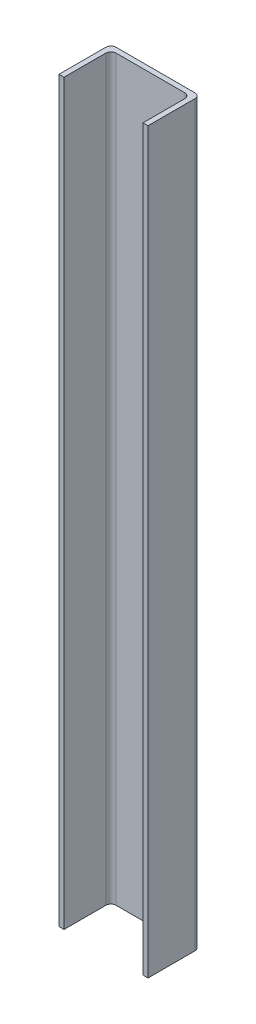
ISO-10303-21;
HEADER;
FILE_DESCRIPTION(('STEP AP214'),'2;1');
FILE_NAME('part.step','',(''),(''),'','','');
FILE_SCHEMA(('AUTOMOTIVE_DESIGN { 1 0 10303 214 1 1 1 1 }'));
ENDSEC;
DATA;
#1=APPLICATION_CONTEXT('core data for automotive mechanical design processes');
#2=APPLICATION_PROTOCOL_DEFINITION('international standard','automotive_design',2000,#1);
#3=PRODUCT_CONTEXT('',#1,'mechanical');
#4=PRODUCT('Part','Part','',(#3));
#5=PRODUCT_RELATED_PRODUCT_CATEGORY('part','',(#4));
#6=PRODUCT_DEFINITION_FORMATION('','',#4);
#7=PRODUCT_DEFINITION_CONTEXT('part definition',#1,'design');
#8=PRODUCT_DEFINITION('design','',#6,#7);
#9=PRODUCT_DEFINITION_SHAPE('','',#8);
#10=(LENGTH_UNIT() NAMED_UNIT(*) SI_UNIT(.MILLI.,.METRE.));
#11=(NAMED_UNIT(*) PLANE_ANGLE_UNIT() SI_UNIT($,.RADIAN.));
#12=(NAMED_UNIT(*) SI_UNIT($,.STERADIAN.) SOLID_ANGLE_UNIT());
#13=UNCERTAINTY_MEASURE_WITH_UNIT(LENGTH_MEASURE(1.E-05),#10,'distance_accuracy_value','');
#14=(GEOMETRIC_REPRESENTATION_CONTEXT(3) GLOBAL_UNCERTAINTY_ASSIGNED_CONTEXT((#13)) GLOBAL_UNIT_ASSIGNED_CONTEXT((#10,
#11,#12)) REPRESENTATION_CONTEXT('',''));
#15=CARTESIAN_POINT('',(0.,0.,0.));
#16=DIRECTION('',(0.,0.,1.));
#17=DIRECTION('',(1.,0.,0.));
#18=AXIS2_PLACEMENT_3D('',#15,#16,#17);
#19=CARTESIAN_POINT('',(33.782,631.317,22.225));
#20=DIRECTION('',(0.,0.,-1.));
#21=DIRECTION('',(-1.,0.,0.));
#22=AXIS2_PLACEMENT_3D('',#19,#20,#21);
#23=PLANE('',#22);
#24=DIRECTION('',(1.,0.,0.));
#25=VECTOR('',#24,1.);
#26=CARTESIAN_POINT('',(33.782,0.,22.225));
#27=LINE('',#26,#25);
#28=CARTESIAN_POINT('',(33.782,0.,22.225));
#29=VERTEX_POINT('',#28);
#30=CARTESIAN_POINT('',(38.1,0.,22.225));
#31=VERTEX_POINT('',#30);
#32=EDGE_CURVE('E159',#29,#31,#27,.T.);
#33=ORIENTED_EDGE('',*,*,#32,.T.);
#34=DIRECTION('',(0.,-1.,0.));
#35=VECTOR('',#34,1.);
#36=CARTESIAN_POINT('',(38.1,631.317,22.225));
#37=LINE('',#36,#35);
#38=CARTESIAN_POINT('',(38.1,631.317,22.225));
#39=VERTEX_POINT('',#38);
#40=EDGE_CURVE('E11',#39,#31,#37,.T.);
#41=ORIENTED_EDGE('',*,*,#40,.F.);
#42=DIRECTION('',(1.,0.,0.));
#43=VECTOR('',#42,1.);
#44=CARTESIAN_POINT('',(33.782,631.317,22.225));
#45=LINE('',#44,#43);
#46=CARTESIAN_POINT('',(33.782,631.317,22.225));
#47=VERTEX_POINT('',#46);
#48=EDGE_CURVE('E181',#47,#39,#45,.T.);
#49=ORIENTED_EDGE('',*,*,#48,.F.);
#50=DIRECTION('',(0.,-1.,0.));
#51=VECTOR('',#50,1.);
#52=CARTESIAN_POINT('',(33.782,631.317,22.225));
#53=LINE('',#52,#51);
#54=EDGE_CURVE('E155',#47,#29,#53,.T.);
#55=ORIENTED_EDGE('',*,*,#54,.T.);
#56=EDGE_LOOP('',(#33,#41,#49,#55));
#57=FACE_BOUND('',#56,.T.);
#58=ADVANCED_FACE('F39',(#57),#23,.F.);
#59=CARTESIAN_POINT('',(38.1,631.317,-17.907));
#60=DIRECTION('',(-1.,0.,0.));
#61=DIRECTION('',(0.,0.,1.));
#62=AXIS2_PLACEMENT_3D('',#59,#60,#61);
#63=PLANE('',#62);
#64=DIRECTION('',(0.,0.,-1.));
#65=VECTOR('',#64,1.);
#66=CARTESIAN_POINT('',(38.1,0.,-17.907));
#67=LINE('',#66,#65);
#68=CARTESIAN_POINT('',(38.1,0.,-17.907));
#69=VERTEX_POINT('',#68);
#70=EDGE_CURVE('E162',#31,#69,#67,.T.);
#71=ORIENTED_EDGE('',*,*,#70,.T.);
#72=DIRECTION('',(0.,-1.,0.));
#73=VECTOR('',#72,1.);
#74=CARTESIAN_POINT('',(38.1,631.317,-17.907));
#75=LINE('',#74,#73);
#76=CARTESIAN_POINT('',(38.1,631.317,-17.907));
#77=VERTEX_POINT('',#76);
#78=EDGE_CURVE('E47',#77,#69,#75,.T.);
#79=ORIENTED_EDGE('',*,*,#78,.F.);
#80=DIRECTION('',(0.,0.,-1.));
#81=VECTOR('',#80,1.);
#82=CARTESIAN_POINT('',(38.1,631.317,-17.907));
#83=LINE('',#82,#81);
#84=EDGE_CURVE('E110',#39,#77,#83,.T.);
#85=ORIENTED_EDGE('',*,*,#84,.F.);
#86=ORIENTED_EDGE('',*,*,#40,.T.);
#87=EDGE_LOOP('',(#71,#79,#85,#86));
#88=FACE_BOUND('',#87,.T.);
#89=ADVANCED_FACE('F259',(#88),#63,.F.);
#90=CARTESIAN_POINT('',(33.782,631.317,-17.907));
#91=DIRECTION('',(0.,-1.,0.));
#92=DIRECTION('',(0.,0.,-1.));
#93=AXIS2_PLACEMENT_3D('',#90,#91,#92);
#94=CYLINDRICAL_SURFACE('',#93,4.318);
#95=CARTESIAN_POINT('',(33.782,0.,-17.907));
#96=DIRECTION('',(0.,1.,0.));
#97=DIRECTION('',(0.,0.,-1.));
#98=AXIS2_PLACEMENT_3D('',#95,#96,#97);
#99=CIRCLE('',#98,4.318);
#100=CARTESIAN_POINT('',(33.782,0.,-22.225));
#101=VERTEX_POINT('',#100);
#102=EDGE_CURVE('E164',#69,#101,#99,.T.);
#103=ORIENTED_EDGE('',*,*,#102,.T.);
#104=DIRECTION('',(0.,-1.,0.));
#105=VECTOR('',#104,1.);
#106=CARTESIAN_POINT('',(33.782,631.317,-22.225));
#107=LINE('',#106,#105);
#108=CARTESIAN_POINT('',(33.782,631.317,-22.225));
#109=VERTEX_POINT('',#108);
#110=EDGE_CURVE('E200',#109,#101,#107,.T.);
#111=ORIENTED_EDGE('',*,*,#110,.F.);
#112=CARTESIAN_POINT('',(33.782,631.317,-17.907));
#113=DIRECTION('',(0.,1.,0.));
#114=DIRECTION('',(0.,0.,-1.));
#115=AXIS2_PLACEMENT_3D('',#112,#113,#114);
#116=CIRCLE('',#115,4.318);
#117=EDGE_CURVE('E208',#77,#109,#116,.T.);
#118=ORIENTED_EDGE('',*,*,#117,.F.);
#119=ORIENTED_EDGE('',*,*,#78,.T.);
#120=EDGE_LOOP('',(#103,#111,#118,#119));
#121=FACE_BOUND('',#120,.T.);
#122=ADVANCED_FACE('F206',(#121),#94,.T.);
#123=CARTESIAN_POINT('',(-33.782,631.317,-22.225));
#124=DIRECTION('',(0.,0.,1.));
#125=DIRECTION('',(1.,0.,0.));
#126=AXIS2_PLACEMENT_3D('',#123,#124,#125);
#127=PLANE('',#126);
#128=DIRECTION('',(-1.,0.,0.));
#129=VECTOR('',#128,1.);
#130=CARTESIAN_POINT('',(-33.782,0.,-22.225));
#131=LINE('',#130,#129);
#132=CARTESIAN_POINT('',(-33.782,0.,-22.225));
#133=VERTEX_POINT('',#132);
#134=EDGE_CURVE('E166',#101,#133,#131,.T.);
#135=ORIENTED_EDGE('',*,*,#134,.T.);
#136=DIRECTION('',(0.,-1.,0.));
#137=VECTOR('',#136,1.);
#138=CARTESIAN_POINT('',(-33.782,631.317,-22.225));
#139=LINE('',#138,#137);
#140=CARTESIAN_POINT('',(-33.782,631.317,-22.225));
#141=VERTEX_POINT('',#140);
#142=EDGE_CURVE('E197',#141,#133,#139,.T.);
#143=ORIENTED_EDGE('',*,*,#142,.F.);
#144=DIRECTION('',(-1.,0.,0.));
#145=VECTOR('',#144,1.);
#146=CARTESIAN_POINT('',(-33.782,631.317,-22.225));
#147=LINE('',#146,#145);
#148=EDGE_CURVE('E226',#109,#141,#147,.T.);
#149=ORIENTED_EDGE('',*,*,#148,.F.);
#150=ORIENTED_EDGE('',*,*,#110,.T.);
#151=EDGE_LOOP('',(#135,#143,#149,#150));
#152=FACE_BOUND('',#151,.T.);
#153=ADVANCED_FACE('F217',(#152),#127,.F.);
#154=CARTESIAN_POINT('',(-33.782,631.317,-17.907));
#155=DIRECTION('',(0.,-1.,0.));
#156=DIRECTION('',(0.,0.,-1.));
#157=AXIS2_PLACEMENT_3D('',#154,#155,#156);
#158=CYLINDRICAL_SURFACE('',#157,4.318);
#159=CARTESIAN_POINT('',(-33.782,0.,-17.907));
#160=DIRECTION('',(0.,1.,0.));
#161=DIRECTION('',(0.,0.,1.));
#162=AXIS2_PLACEMENT_3D('',#159,#160,#161);
#163=CIRCLE('',#162,4.318);
#164=CARTESIAN_POINT('',(-38.1,0.,-17.907));
#165=VERTEX_POINT('',#164);
#166=EDGE_CURVE('E168',#133,#165,#163,.T.);
#167=ORIENTED_EDGE('',*,*,#166,.T.);
#168=DIRECTION('',(0.,-1.,0.));
#169=VECTOR('',#168,1.);
#170=CARTESIAN_POINT('',(-38.1,631.317,-17.907));
#171=LINE('',#170,#169);
#172=CARTESIAN_POINT('',(-38.1,631.317,-17.907));
#173=VERTEX_POINT('',#172);
#174=EDGE_CURVE('E194',#173,#165,#171,.T.);
#175=ORIENTED_EDGE('',*,*,#174,.F.);
#176=CARTESIAN_POINT('',(-33.782,631.317,-17.907));
#177=DIRECTION('',(0.,1.,0.));
#178=DIRECTION('',(0.,0.,1.));
#179=AXIS2_PLACEMENT_3D('',#176,#177,#178);
#180=CIRCLE('',#179,4.318);
#181=EDGE_CURVE('E223',#141,#173,#180,.T.);
#182=ORIENTED_EDGE('',*,*,#181,.F.);
#183=ORIENTED_EDGE('',*,*,#142,.T.);
#184=EDGE_LOOP('',(#167,#175,#182,#183));
#185=FACE_BOUND('',#184,.T.);
#186=ADVANCED_FACE('F221',(#185),#158,.T.);
#187=CARTESIAN_POINT('',(-38.1,631.317,-17.907));
#188=DIRECTION('',(1.,0.,0.));
#189=DIRECTION('',(0.,0.,-1.));
#190=AXIS2_PLACEMENT_3D('',#187,#188,#189);
#191=PLANE('',#190);
#192=DIRECTION('',(0.,0.,1.));
#193=VECTOR('',#192,1.);
#194=CARTESIAN_POINT('',(-38.1,0.,-17.907));
#195=LINE('',#194,#193);
#196=CARTESIAN_POINT('',(-38.1,0.,22.225));
#197=VERTEX_POINT('',#196);
#198=EDGE_CURVE('E170',#165,#197,#195,.T.);
#199=ORIENTED_EDGE('',*,*,#198,.T.);
#200=DIRECTION('',(0.,-1.,0.));
#201=VECTOR('',#200,1.);
#202=CARTESIAN_POINT('',(-38.1,631.317,22.225));
#203=LINE('',#202,#201);
#204=CARTESIAN_POINT('',(-38.1,631.317,22.225));
#205=VERTEX_POINT('',#204);
#206=EDGE_CURVE('E191',#205,#197,#203,.T.);
#207=ORIENTED_EDGE('',*,*,#206,.F.);
#208=DIRECTION('',(0.,0.,1.));
#209=VECTOR('',#208,1.);
#210=CARTESIAN_POINT('',(-38.1,631.317,-17.907));
#211=LINE('',#210,#209);
#212=EDGE_CURVE('E225',#173,#205,#211,.T.);
#213=ORIENTED_EDGE('',*,*,#212,.F.);
#214=ORIENTED_EDGE('',*,*,#174,.T.);
#215=EDGE_LOOP('',(#199,#207,#213,#214));
#216=FACE_BOUND('',#215,.T.);
#217=ADVANCED_FACE('F272',(#216),#191,.F.);
#218=CARTESIAN_POINT('',(-38.1,631.317,22.225));
#219=DIRECTION('',(0.,0.,-1.));
#220=DIRECTION('',(-1.,0.,0.));
#221=AXIS2_PLACEMENT_3D('',#218,#219,#220);
#222=PLANE('',#221);
#223=DIRECTION('',(1.,0.,0.));
#224=VECTOR('',#223,1.);
#225=CARTESIAN_POINT('',(-38.1,0.,22.225));
#226=LINE('',#225,#224);
#227=CARTESIAN_POINT('',(-33.782,0.,22.225));
#228=VERTEX_POINT('',#227);
#229=EDGE_CURVE('E172',#197,#228,#226,.T.);
#230=ORIENTED_EDGE('',*,*,#229,.T.);
#231=DIRECTION('',(0.,-1.,0.));
#232=VECTOR('',#231,1.);
#233=CARTESIAN_POINT('',(-33.782,631.317,22.225));
#234=LINE('',#233,#232);
#235=CARTESIAN_POINT('',(-33.782,631.317,22.225));
#236=VERTEX_POINT('',#235);
#237=EDGE_CURVE('E188',#236,#228,#234,.T.);
#238=ORIENTED_EDGE('',*,*,#237,.F.);
#239=DIRECTION('',(1.,0.,0.));
#240=VECTOR('',#239,1.);
#241=CARTESIAN_POINT('',(-38.1,631.317,22.225));
#242=LINE('',#241,#240);
#243=EDGE_CURVE('E228',#205,#236,#242,.T.);
#244=ORIENTED_EDGE('',*,*,#243,.F.);
#245=ORIENTED_EDGE('',*,*,#206,.T.);
#246=EDGE_LOOP('',(#230,#238,#244,#245));
#247=FACE_BOUND('',#246,.T.);
#248=ADVANCED_FACE('F275',(#247),#222,.F.);
#249=CARTESIAN_POINT('',(-33.782,631.317,22.225));
#250=DIRECTION('',(-1.,0.,0.));
#251=DIRECTION('',(0.,0.,1.));
#252=AXIS2_PLACEMENT_3D('',#249,#250,#251);
#253=PLANE('',#252);
#254=DIRECTION('',(0.,0.,-1.));
#255=VECTOR('',#254,1.);
#256=CARTESIAN_POINT('',(-33.782,0.,22.225));
#257=LINE('',#256,#255);
#258=CARTESIAN_POINT('',(-33.782,0.,-13.589));
#259=VERTEX_POINT('',#258);
#260=EDGE_CURVE('E174',#228,#259,#257,.T.);
#261=ORIENTED_EDGE('',*,*,#260,.T.);
#262=DIRECTION('',(0.,-1.,0.));
#263=VECTOR('',#262,1.);
#264=CARTESIAN_POINT('',(-33.782,631.317,-13.589));
#265=LINE('',#264,#263);
#266=CARTESIAN_POINT('',(-33.782,631.317,-13.589));
#267=VERTEX_POINT('',#266);
#268=EDGE_CURVE('E185',#267,#259,#265,.T.);
#269=ORIENTED_EDGE('',*,*,#268,.F.);
#270=DIRECTION('',(0.,0.,-1.));
#271=VECTOR('',#270,1.);
#272=CARTESIAN_POINT('',(-33.782,631.317,22.225));
#273=LINE('',#272,#271);
#274=EDGE_CURVE('E234',#236,#267,#273,.T.);
#275=ORIENTED_EDGE('',*,*,#274,.F.);
#276=ORIENTED_EDGE('',*,*,#237,.T.);
#277=EDGE_LOOP('',(#261,#269,#275,#276));
#278=FACE_BOUND('',#277,.T.);
#279=ADVANCED_FACE('F240',(#278),#253,.F.);
#280=CARTESIAN_POINT('',(-29.464,631.317,-13.589));
#281=DIRECTION('',(0.,-1.,0.));
#282=DIRECTION('',(0.,0.,-1.));
#283=AXIS2_PLACEMENT_3D('',#280,#281,#282);
#284=CYLINDRICAL_SURFACE('',#283,4.318);
#285=CARTESIAN_POINT('',(-29.464,0.,-13.589));
#286=DIRECTION('',(0.,-1.,0.));
#287=DIRECTION('',(0.,0.,-1.));
#288=AXIS2_PLACEMENT_3D('',#285,#286,#287);
#289=CIRCLE('',#288,4.318);
#290=CARTESIAN_POINT('',(-29.464,0.,-17.907));
#291=VERTEX_POINT('',#290);
#292=EDGE_CURVE('E176',#259,#291,#289,.T.);
#293=ORIENTED_EDGE('',*,*,#292,.T.);
#294=DIRECTION('',(0.,-1.,0.));
#295=VECTOR('',#294,1.);
#296=CARTESIAN_POINT('',(-29.464,631.317,-17.907));
#297=LINE('',#296,#295);
#298=CARTESIAN_POINT('',(-29.464,631.317,-17.907));
#299=VERTEX_POINT('',#298);
#300=EDGE_CURVE('E150',#299,#291,#297,.T.);
#301=ORIENTED_EDGE('',*,*,#300,.F.);
#302=CARTESIAN_POINT('',(-29.464,631.317,-13.589));
#303=DIRECTION('',(0.,-1.,0.));
#304=DIRECTION('',(0.,0.,-1.));
#305=AXIS2_PLACEMENT_3D('',#302,#303,#304);
#306=CIRCLE('',#305,4.318);
#307=EDGE_CURVE('E141',#267,#299,#306,.T.);
#308=ORIENTED_EDGE('',*,*,#307,.F.);
#309=ORIENTED_EDGE('',*,*,#268,.T.);
#310=EDGE_LOOP('',(#293,#301,#308,#309));
#311=FACE_BOUND('',#310,.T.);
#312=ADVANCED_FACE('F244',(#311),#284,.F.);
#313=CARTESIAN_POINT('',(-29.464,631.317,-17.907));
#314=DIRECTION('',(0.,0.,-1.));
#315=DIRECTION('',(-1.,0.,0.));
#316=AXIS2_PLACEMENT_3D('',#313,#314,#315);
#317=PLANE('',#316);
#318=DIRECTION('',(1.,0.,0.));
#319=VECTOR('',#318,1.);
#320=CARTESIAN_POINT('',(-29.464,0.,-17.907));
#321=LINE('',#320,#319);
#322=CARTESIAN_POINT('',(29.464,0.,-17.907));
#323=VERTEX_POINT('',#322);
#324=EDGE_CURVE('E149',#291,#323,#321,.T.);
#325=ORIENTED_EDGE('',*,*,#324,.T.);
#326=DIRECTION('',(0.,-1.,0.));
#327=VECTOR('',#326,1.);
#328=CARTESIAN_POINT('',(29.464,631.317,-17.907));
#329=LINE('',#328,#327);
#330=CARTESIAN_POINT('',(29.464,631.317,-17.907));
#331=VERTEX_POINT('',#330);
#332=EDGE_CURVE('E146',#331,#323,#329,.T.);
#333=ORIENTED_EDGE('',*,*,#332,.F.);
#334=DIRECTION('',(1.,0.,0.));
#335=VECTOR('',#334,1.);
#336=CARTESIAN_POINT('',(-29.464,631.317,-17.907));
#337=LINE('',#336,#335);
#338=EDGE_CURVE('E135',#299,#331,#337,.T.);
#339=ORIENTED_EDGE('',*,*,#338,.F.);
#340=ORIENTED_EDGE('',*,*,#300,.T.);
#341=EDGE_LOOP('',(#325,#333,#339,#340));
#342=FACE_BOUND('',#341,.T.);
#343=ADVANCED_FACE('F147',(#342),#317,.F.);
#344=CARTESIAN_POINT('',(29.464,631.317,-13.589));
#345=DIRECTION('',(0.,-1.,0.));
#346=DIRECTION('',(0.,0.,-1.));
#347=AXIS2_PLACEMENT_3D('',#344,#345,#346);
#348=CYLINDRICAL_SURFACE('',#347,4.318);
#349=CARTESIAN_POINT('',(29.464,0.,-13.589));
#350=DIRECTION('',(0.,-1.,0.));
#351=DIRECTION('',(0.,0.,-1.));
#352=AXIS2_PLACEMENT_3D('',#349,#350,#351);
#353=CIRCLE('',#352,4.318);
#354=CARTESIAN_POINT('',(33.782,0.,-13.589));
#355=VERTEX_POINT('',#354);
#356=EDGE_CURVE('E96',#323,#355,#353,.T.);
#357=ORIENTED_EDGE('',*,*,#356,.T.);
#358=DIRECTION('',(0.,-1.,0.));
#359=VECTOR('',#358,1.);
#360=CARTESIAN_POINT('',(33.782,631.317,-13.589));
#361=LINE('',#360,#359);
#362=CARTESIAN_POINT('',(33.782,631.317,-13.589));
#363=VERTEX_POINT('',#362);
#364=EDGE_CURVE('E151',#363,#355,#361,.T.);
#365=ORIENTED_EDGE('',*,*,#364,.F.);
#366=CARTESIAN_POINT('',(29.464,631.317,-13.589));
#367=DIRECTION('',(0.,-1.,0.));
#368=DIRECTION('',(0.,0.,-1.));
#369=AXIS2_PLACEMENT_3D('',#366,#367,#368);
#370=CIRCLE('',#369,4.318);
#371=EDGE_CURVE('E139',#331,#363,#370,.T.);
#372=ORIENTED_EDGE('',*,*,#371,.F.);
#373=ORIENTED_EDGE('',*,*,#332,.T.);
#374=EDGE_LOOP('',(#357,#365,#372,#373));
#375=FACE_BOUND('',#374,.T.);
#376=ADVANCED_FACE('F153',(#375),#348,.F.);
#377=CARTESIAN_POINT('',(33.782,631.317,-13.589));
#378=DIRECTION('',(1.,0.,0.));
#379=DIRECTION('',(0.,0.,-1.));
#380=AXIS2_PLACEMENT_3D('',#377,#378,#379);
#381=PLANE('',#380);
#382=DIRECTION('',(0.,0.,1.));
#383=VECTOR('',#382,1.);
#384=CARTESIAN_POINT('',(33.782,0.,-13.589));
#385=LINE('',#384,#383);
#386=EDGE_CURVE('E102',#355,#29,#385,.T.);
#387=ORIENTED_EDGE('',*,*,#386,.T.);
#388=ORIENTED_EDGE('',*,*,#54,.F.);
#389=DIRECTION('',(0.,0.,1.));
#390=VECTOR('',#389,1.);
#391=CARTESIAN_POINT('',(33.782,631.317,-13.589));
#392=LINE('',#391,#390);
#393=EDGE_CURVE('E55',#363,#47,#392,.T.);
#394=ORIENTED_EDGE('',*,*,#393,.F.);
#395=ORIENTED_EDGE('',*,*,#364,.T.);
#396=EDGE_LOOP('',(#387,#388,#394,#395));
#397=FACE_BOUND('',#396,.T.);
#398=ADVANCED_FACE('F248',(#397),#381,.F.);
#399=CARTESIAN_POINT('',(33.782,631.317,-17.907));
#400=DIRECTION('',(0.,-1.,0.));
#401=DIRECTION('',(0.,0.,-1.));
#402=AXIS2_PLACEMENT_3D('',#399,#400,#401);
#403=PLANE('',#402);
#404=ORIENTED_EDGE('',*,*,#48,.T.);
#405=ORIENTED_EDGE('',*,*,#84,.T.);
#406=ORIENTED_EDGE('',*,*,#117,.T.);
#407=ORIENTED_EDGE('',*,*,#148,.T.);
#408=ORIENTED_EDGE('',*,*,#181,.T.);
#409=ORIENTED_EDGE('',*,*,#212,.T.);
#410=ORIENTED_EDGE('',*,*,#243,.T.);
#411=ORIENTED_EDGE('',*,*,#274,.T.);
#412=ORIENTED_EDGE('',*,*,#307,.T.);
#413=ORIENTED_EDGE('',*,*,#338,.T.);
#414=ORIENTED_EDGE('',*,*,#371,.T.);
#415=ORIENTED_EDGE('',*,*,#393,.T.);
#416=EDGE_LOOP('',(#404,#405,#406,#407,#408,#409,#410,#411,#412,#413,#414,#415));
#417=FACE_BOUND('',#416,.T.);
#418=ADVANCED_FACE('F137',(#417),#403,.F.);
#419=CARTESIAN_POINT('',(33.782,0.,-17.907));
#420=DIRECTION('',(0.,-1.,0.));
#421=DIRECTION('',(0.,0.,-1.));
#422=AXIS2_PLACEMENT_3D('',#419,#420,#421);
#423=PLANE('',#422);
#424=ORIENTED_EDGE('',*,*,#32,.F.);
#425=ORIENTED_EDGE('',*,*,#386,.F.);
#426=ORIENTED_EDGE('',*,*,#356,.F.);
#427=ORIENTED_EDGE('',*,*,#324,.F.);
#428=ORIENTED_EDGE('',*,*,#292,.F.);
#429=ORIENTED_EDGE('',*,*,#260,.F.);
#430=ORIENTED_EDGE('',*,*,#229,.F.);
#431=ORIENTED_EDGE('',*,*,#198,.F.);
#432=ORIENTED_EDGE('',*,*,#166,.F.);
#433=ORIENTED_EDGE('',*,*,#134,.F.);
#434=ORIENTED_EDGE('',*,*,#102,.F.);
#435=ORIENTED_EDGE('',*,*,#70,.F.);
#436=EDGE_LOOP('',(#424,#425,#426,#427,#428,#429,#430,#431,#432,#433,#434,#435));
#437=FACE_BOUND('',#436,.T.);
#438=ADVANCED_FACE('F212',(#437),#423,.T.);
#439=CLOSED_SHELL('',(#58,#89,#122,#153,#186,#217,#248,#279,#312,#343,#376,#398,#418,#438));
#440=MANIFOLD_SOLID_BREP('B2',#439);
#441=ADVANCED_BREP_SHAPE_REPRESENTATION('',(#18,#440),#14);
#442=SHAPE_DEFINITION_REPRESENTATION(#9,#441);
ENDSEC;
END-ISO-10303-21;
